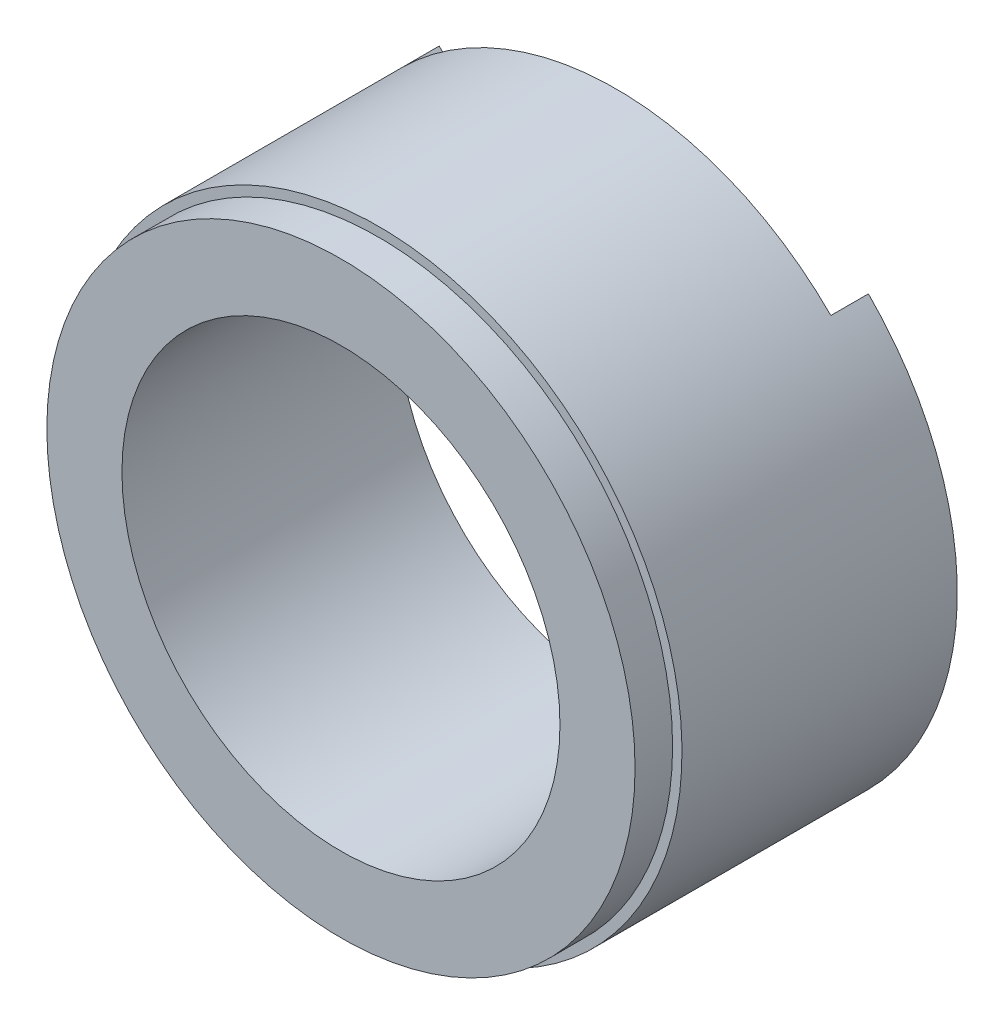
ISO-10303-21;
HEADER;
FILE_DESCRIPTION(('STEP AP214'),'2;1');
FILE_NAME('part.step','',(''),(''),'','','');
FILE_SCHEMA(('AUTOMOTIVE_DESIGN { 1 0 10303 214 1 1 1 1 }'));
ENDSEC;
DATA;
#1=APPLICATION_CONTEXT('core data for automotive mechanical design processes');
#2=APPLICATION_PROTOCOL_DEFINITION('international standard','automotive_design',2000,#1);
#3=PRODUCT_CONTEXT('',#1,'mechanical');
#4=PRODUCT('Part','Part','',(#3));
#5=PRODUCT_RELATED_PRODUCT_CATEGORY('part','',(#4));
#6=PRODUCT_DEFINITION_FORMATION('','',#4);
#7=PRODUCT_DEFINITION_CONTEXT('part definition',#1,'design');
#8=PRODUCT_DEFINITION('design','',#6,#7);
#9=PRODUCT_DEFINITION_SHAPE('','',#8);
#10=(LENGTH_UNIT() NAMED_UNIT(*) SI_UNIT(.MILLI.,.METRE.));
#11=(NAMED_UNIT(*) PLANE_ANGLE_UNIT() SI_UNIT($,.RADIAN.));
#12=(NAMED_UNIT(*) SI_UNIT($,.STERADIAN.) SOLID_ANGLE_UNIT());
#13=UNCERTAINTY_MEASURE_WITH_UNIT(LENGTH_MEASURE(1.E-05),#10,'distance_accuracy_value','');
#14=(GEOMETRIC_REPRESENTATION_CONTEXT(3) GLOBAL_UNCERTAINTY_ASSIGNED_CONTEXT((#13)) GLOBAL_UNIT_ASSIGNED_CONTEXT((#10,
#11,#12)) REPRESENTATION_CONTEXT('',''));
#15=CARTESIAN_POINT('',(0.,0.,0.));
#16=DIRECTION('',(0.,0.,1.));
#17=DIRECTION('',(1.,0.,0.));
#18=AXIS2_PLACEMENT_3D('',#15,#16,#17);
#19=CARTESIAN_POINT('',(0.,0.,0.));
#20=DIRECTION('',(0.,0.,1.));
#21=DIRECTION('',(1.,0.,0.));
#22=AXIS2_PLACEMENT_3D('',#19,#20,#21);
#23=PLANE('',#22);
#24=DIRECTION('',(-0.707106781186556,0.707106781186539,0.));
#25=VECTOR('',#24,1.);
#26=CARTESIAN_POINT('',(34.2946788875477,-34.2946788875473,0.));
#27=LINE('',#26,#25);
#28=CARTESIAN_POINT('',(34.2946788875478,-34.2946788875474,0.));
#29=VERTEX_POINT('',#28);
#30=CARTESIAN_POINT('',(32.1733585439881,-32.1733585439877,0.));
#31=VERTEX_POINT('',#30);
#32=EDGE_CURVE('E54',#29,#31,#27,.T.);
#33=ORIENTED_EDGE('',*,*,#32,.F.);
#34=CARTESIAN_POINT('',(0.,0.,0.));
#35=DIRECTION('',(0.,0.,1.));
#36=DIRECTION('',(1.,0.,0.));
#37=AXIS2_PLACEMENT_3D('',#34,#35,#36);
#38=CIRCLE('',#37,48.5);
#39=CARTESIAN_POINT('',(10.,-47.4578760586691,0.));
#40=VERTEX_POINT('',#39);
#41=EDGE_CURVE('E11',#40,#29,#38,.T.);
#42=ORIENTED_EDGE('',*,*,#41,.F.);
#43=DIRECTION('',(0.,-1.,0.));
#44=VECTOR('',#43,1.);
#45=CARTESIAN_POINT('',(10.,-48.5543279942272,0.));
#46=LINE('',#45,#44);
#47=CARTESIAN_POINT('',(10.,-44.3874982399324,0.));
#48=VERTEX_POINT('',#47);
#49=EDGE_CURVE('E224',#48,#40,#46,.T.);
#50=ORIENTED_EDGE('',*,*,#49,.F.);
#51=CARTESIAN_POINT('',(0.,0.,0.));
#52=DIRECTION('',(0.,0.,-1.));
#53=DIRECTION('',(-1.,0.,0.));
#54=AXIS2_PLACEMENT_3D('',#51,#52,#53);
#55=CIRCLE('',#54,45.5);
#56=EDGE_CURVE('E154',#31,#48,#55,.T.);
#57=ORIENTED_EDGE('',*,*,#56,.F.);
#58=EDGE_LOOP('',(#33,#42,#50,#57));
#59=FACE_BOUND('',#58,.T.);
#60=ADVANCED_FACE('F38',(#59),#23,.F.);
#61=CARTESIAN_POINT('',(34.2946788875477,34.2946788875472,0.));
#62=VERTEX_POINT('',#61);
#63=CARTESIAN_POINT('',(-34.2946788875478,34.2946788875473,0.));
#64=VERTEX_POINT('',#63);
#65=EDGE_CURVE('E46',#62,#64,#38,.T.);
#66=ORIENTED_EDGE('',*,*,#65,.F.);
#67=DIRECTION('',(-0.707106781186553,-0.707106781186542,0.));
#68=VECTOR('',#67,1.);
#69=CARTESIAN_POINT('',(34.2946788875477,34.2946788875473,0.));
#70=LINE('',#69,#68);
#71=CARTESIAN_POINT('',(32.1733585439881,32.1733585439877,0.));
#72=VERTEX_POINT('',#71);
#73=EDGE_CURVE('E155',#62,#72,#70,.T.);
#74=ORIENTED_EDGE('',*,*,#73,.T.);
#75=CARTESIAN_POINT('',(-32.1733585439881,32.1733585439877,0.));
#76=VERTEX_POINT('',#75);
#77=EDGE_CURVE('E185',#76,#72,#55,.T.);
#78=ORIENTED_EDGE('',*,*,#77,.F.);
#79=DIRECTION('',(0.707106781186552,-0.707106781186543,0.));
#80=VECTOR('',#79,1.);
#81=CARTESIAN_POINT('',(0.,0.,0.));
#82=LINE('',#81,#80);
#83=EDGE_CURVE('E211',#64,#76,#82,.T.);
#84=ORIENTED_EDGE('',*,*,#83,.F.);
#85=EDGE_LOOP('',(#66,#74,#78,#84));
#86=FACE_BOUND('',#85,.T.);
#87=ADVANCED_FACE('F212',(#86),#23,.F.);
#88=CARTESIAN_POINT('',(0.,0.,0.));
#89=DIRECTION('',(0.,0.,1.));
#90=DIRECTION('',(1.,0.,0.));
#91=AXIS2_PLACEMENT_3D('',#88,#89,#90);
#92=CIRCLE('',#91,35.);
#93=CARTESIAN_POINT('',(35.,0.,0.));
#94=VERTEX_POINT('',#93);
#95=EDGE_CURVE('E186',#94,#94,#92,.T.);
#96=ORIENTED_EDGE('',*,*,#95,.T.);
#97=EDGE_LOOP('',(#96));
#98=FACE_BOUND('',#97,.T.);
#99=CARTESIAN_POINT('',(0.,0.,0.));
#100=DIRECTION('',(0.,0.,-1.));
#101=DIRECTION('',(-1.,0.,0.));
#102=AXIS2_PLACEMENT_3D('',#99,#100,#101);
#103=CIRCLE('',#102,36.5);
#104=CARTESIAN_POINT('',(-36.5,0.,0.));
#105=VERTEX_POINT('',#104);
#106=EDGE_CURVE('E168',#105,#105,#103,.T.);
#107=ORIENTED_EDGE('',*,*,#106,.T.);
#108=EDGE_LOOP('',(#107));
#109=FACE_BOUND('',#108,.T.);
#110=ADVANCED_FACE('F276',(#98,#109),#23,.F.);
#111=CARTESIAN_POINT('',(0.,0.,44.));
#112=DIRECTION('',(0.,0.,-1.));
#113=DIRECTION('',(-1.,0.,0.));
#114=AXIS2_PLACEMENT_3D('',#111,#112,#113);
#115=CYLINDRICAL_SURFACE('',#114,48.5);
#116=CARTESIAN_POINT('',(0.,0.,38.));
#117=DIRECTION('',(0.,0.,1.));
#118=DIRECTION('',(1.,0.,0.));
#119=AXIS2_PLACEMENT_3D('',#116,#117,#118);
#120=CIRCLE('',#119,48.5);
#121=CARTESIAN_POINT('',(10.,-47.4578760586691,38.));
#122=VERTEX_POINT('',#121);
#123=CARTESIAN_POINT('',(-10.,-47.4578760586691,38.));
#124=VERTEX_POINT('',#123);
#125=EDGE_CURVE('E162',#122,#124,#120,.T.);
#126=ORIENTED_EDGE('',*,*,#125,.F.);
#127=DIRECTION('',(0.,0.,-1.));
#128=VECTOR('',#127,1.);
#129=CARTESIAN_POINT('',(10.,-47.4578760586691,44.));
#130=LINE('',#129,#128);
#131=EDGE_CURVE('E159',#122,#40,#130,.T.);
#132=ORIENTED_EDGE('',*,*,#131,.T.);
#133=ORIENTED_EDGE('',*,*,#41,.T.);
#134=DIRECTION('',(0.,0.,1.));
#135=VECTOR('',#134,1.);
#136=CARTESIAN_POINT('',(34.2946788875478,-34.2946788875474,-6.));
#137=LINE('',#136,#135);
#138=CARTESIAN_POINT('',(34.2946788875478,-34.2946788875474,-6.));
#139=VERTEX_POINT('',#138);
#140=EDGE_CURVE('E140',#139,#29,#137,.T.);
#141=ORIENTED_EDGE('',*,*,#140,.F.);
#142=CARTESIAN_POINT('',(0.,-1.69336844933892E-13,-6.));
#143=DIRECTION('',(0.,0.,1.));
#144=DIRECTION('',(1.,0.,0.));
#145=AXIS2_PLACEMENT_3D('',#142,#143,#144);
#146=CIRCLE('',#145,48.5);
#147=CARTESIAN_POINT('',(34.2946788875477,34.2946788875472,-6.));
#148=VERTEX_POINT('',#147);
#149=EDGE_CURVE('E147',#139,#148,#146,.T.);
#150=ORIENTED_EDGE('',*,*,#149,.T.);
#151=DIRECTION('',(0.,0.,1.));
#152=VECTOR('',#151,1.);
#153=CARTESIAN_POINT('',(34.2946788875477,34.2946788875472,-6.));
#154=LINE('',#153,#152);
#155=EDGE_CURVE('E148',#148,#62,#154,.T.);
#156=ORIENTED_EDGE('',*,*,#155,.T.);
#157=ORIENTED_EDGE('',*,*,#65,.T.);
#158=DIRECTION('',(0.,0.,1.));
#159=VECTOR('',#158,1.);
#160=CARTESIAN_POINT('',(-34.2946788875478,34.2946788875473,-6.));
#161=LINE('',#160,#159);
#162=CARTESIAN_POINT('',(-34.2946788875478,34.2946788875473,-6.));
#163=VERTEX_POINT('',#162);
#164=EDGE_CURVE('E205',#163,#64,#161,.T.);
#165=ORIENTED_EDGE('',*,*,#164,.F.);
#166=CARTESIAN_POINT('',(0.,0.,-6.));
#167=DIRECTION('',(0.,0.,-1.));
#168=DIRECTION('',(-1.,0.,0.));
#169=AXIS2_PLACEMENT_3D('',#166,#167,#168);
#170=CIRCLE('',#169,48.5);
#171=CARTESIAN_POINT('',(-34.2946788875477,-34.2946788875474,-6.));
#172=VERTEX_POINT('',#171);
#173=EDGE_CURVE('E485',#172,#163,#170,.T.);
#174=ORIENTED_EDGE('',*,*,#173,.F.);
#175=DIRECTION('',(0.,0.,1.));
#176=VECTOR('',#175,1.);
#177=CARTESIAN_POINT('',(-34.2946788875477,-34.2946788875474,-6.));
#178=LINE('',#177,#176);
#179=CARTESIAN_POINT('',(-34.2946788875477,-34.2946788875474,0.));
#180=VERTEX_POINT('',#179);
#181=EDGE_CURVE('E221',#172,#180,#178,.T.);
#182=ORIENTED_EDGE('',*,*,#181,.T.);
#183=CARTESIAN_POINT('',(-10.,-47.4578760586691,0.));
#184=VERTEX_POINT('',#183);
#185=EDGE_CURVE('E47',#180,#184,#38,.T.);
#186=ORIENTED_EDGE('',*,*,#185,.T.);
#187=DIRECTION('',(0.,0.,-1.));
#188=VECTOR('',#187,1.);
#189=CARTESIAN_POINT('',(-10.,-47.4578760586691,44.));
#190=LINE('',#189,#188);
#191=EDGE_CURVE('E249',#184,#124,#190,.F.);
#192=ORIENTED_EDGE('',*,*,#191,.T.);
#193=EDGE_LOOP('',(#126,#132,#133,#141,#150,#156,#157,#165,#174,#182,#186,#192));
#194=FACE_BOUND('',#193,.T.);
#195=ADVANCED_FACE('F40',(#194),#115,.T.);
#196=ORIENTED_EDGE('',*,*,#185,.F.);
#197=DIRECTION('',(0.70710678118655,0.707106781186545,0.));
#198=VECTOR('',#197,1.);
#199=CARTESIAN_POINT('',(0.,0.,0.));
#200=LINE('',#199,#198);
#201=CARTESIAN_POINT('',(-32.173358543988,-32.1733585439878,0.));
#202=VERTEX_POINT('',#201);
#203=EDGE_CURVE('E62',#180,#202,#200,.T.);
#204=ORIENTED_EDGE('',*,*,#203,.T.);
#205=CARTESIAN_POINT('',(-10.,-44.3874982399324,0.));
#206=VERTEX_POINT('',#205);
#207=EDGE_CURVE('E183',#206,#202,#55,.T.);
#208=ORIENTED_EDGE('',*,*,#207,.F.);
#209=DIRECTION('',(0.,1.,0.));
#210=VECTOR('',#209,1.);
#211=CARTESIAN_POINT('',(-10.,-48.5543279942272,0.));
#212=LINE('',#211,#210);
#213=EDGE_CURVE('E234',#184,#206,#212,.T.);
#214=ORIENTED_EDGE('',*,*,#213,.F.);
#215=EDGE_LOOP('',(#196,#204,#208,#214));
#216=FACE_BOUND('',#215,.T.);
#217=ADVANCED_FACE('F268',(#216),#23,.F.);
#218=CARTESIAN_POINT('',(0.,0.,38.));
#219=DIRECTION('',(0.,0.,1.));
#220=DIRECTION('',(1.,0.,0.));
#221=AXIS2_PLACEMENT_3D('',#218,#219,#220);
#222=PLANE('',#221);
#223=DIRECTION('',(0.,1.,0.));
#224=VECTOR('',#223,1.);
#225=CARTESIAN_POINT('',(10.,0.,38.));
#226=LINE('',#225,#224);
#227=CARTESIAN_POINT('',(10.,-45.9238500128201,38.));
#228=VERTEX_POINT('',#227);
#229=EDGE_CURVE('E166',#122,#228,#226,.T.);
#230=ORIENTED_EDGE('',*,*,#229,.F.);
#231=ORIENTED_EDGE('',*,*,#125,.T.);
#232=DIRECTION('',(0.,-1.,0.));
#233=VECTOR('',#232,1.);
#234=CARTESIAN_POINT('',(-10.,0.,38.));
#235=LINE('',#234,#233);
#236=CARTESIAN_POINT('',(-10.,-45.9238500128201,38.));
#237=VERTEX_POINT('',#236);
#238=EDGE_CURVE('E247',#237,#124,#235,.T.);
#239=ORIENTED_EDGE('',*,*,#238,.F.);
#240=CARTESIAN_POINT('',(0.,0.,38.));
#241=DIRECTION('',(0.,0.,1.));
#242=DIRECTION('',(1.,0.,0.));
#243=AXIS2_PLACEMENT_3D('',#240,#241,#242);
#244=CIRCLE('',#243,47.);
#245=EDGE_CURVE('E192',#228,#237,#244,.T.);
#246=ORIENTED_EDGE('',*,*,#245,.F.);
#247=EDGE_LOOP('',(#230,#231,#239,#246));
#248=FACE_BOUND('',#247,.T.);
#249=ADVANCED_FACE('F266',(#248),#222,.T.);
#250=CARTESIAN_POINT('',(0.,0.,38.));
#251=DIRECTION('',(0.,0.,1.));
#252=DIRECTION('',(1.,0.,0.));
#253=AXIS2_PLACEMENT_3D('',#250,#251,#252);
#254=CYLINDRICAL_SURFACE('',#253,47.);
#255=DIRECTION('',(0.,0.,1.));
#256=VECTOR('',#255,1.);
#257=CARTESIAN_POINT('',(10.,-45.9238500128201,38.));
#258=LINE('',#257,#256);
#259=CARTESIAN_POINT('',(10.,-45.9238500128201,42.));
#260=VERTEX_POINT('',#259);
#261=EDGE_CURVE('E170',#228,#260,#258,.T.);
#262=ORIENTED_EDGE('',*,*,#261,.F.);
#263=ORIENTED_EDGE('',*,*,#245,.T.);
#264=DIRECTION('',(0.,0.,1.));
#265=VECTOR('',#264,1.);
#266=CARTESIAN_POINT('',(-10.,-45.9238500128201,38.));
#267=LINE('',#266,#265);
#268=CARTESIAN_POINT('',(-10.,-45.9238500128201,42.));
#269=VERTEX_POINT('',#268);
#270=EDGE_CURVE('E243',#269,#237,#267,.F.);
#271=ORIENTED_EDGE('',*,*,#270,.F.);
#272=CARTESIAN_POINT('',(0.,0.,42.));
#273=DIRECTION('',(0.,0.,1.));
#274=DIRECTION('',(1.,0.,0.));
#275=AXIS2_PLACEMENT_3D('',#272,#273,#274);
#276=CIRCLE('',#275,47.);
#277=EDGE_CURVE('E165',#260,#269,#276,.F.);
#278=ORIENTED_EDGE('',*,*,#277,.F.);
#279=EDGE_LOOP('',(#262,#263,#271,#278));
#280=FACE_BOUND('',#279,.T.);
#281=CARTESIAN_POINT('',(0.,0.,44.));
#282=DIRECTION('',(0.,0.,1.));
#283=DIRECTION('',(1.,0.,0.));
#284=AXIS2_PLACEMENT_3D('',#281,#282,#283);
#285=CIRCLE('',#284,47.);
#286=CARTESIAN_POINT('',(47.,0.,44.));
#287=VERTEX_POINT('',#286);
#288=EDGE_CURVE('E189',#287,#287,#285,.T.);
#289=ORIENTED_EDGE('',*,*,#288,.F.);
#290=EDGE_LOOP('',(#289));
#291=FACE_BOUND('',#290,.T.);
#292=ADVANCED_FACE('F262',(#280,#291),#254,.T.);
#293=CARTESIAN_POINT('',(0.,0.,44.));
#294=DIRECTION('',(0.,0.,1.));
#295=DIRECTION('',(1.,0.,0.));
#296=AXIS2_PLACEMENT_3D('',#293,#294,#295);
#297=PLANE('',#296);
#298=CARTESIAN_POINT('',(0.,0.,44.));
#299=DIRECTION('',(0.,0.,1.));
#300=DIRECTION('',(1.,0.,0.));
#301=AXIS2_PLACEMENT_3D('',#298,#299,#300);
#302=CIRCLE('',#301,35.);
#303=CARTESIAN_POINT('',(35.,0.,44.));
#304=VERTEX_POINT('',#303);
#305=EDGE_CURVE('E182',#304,#304,#302,.T.);
#306=ORIENTED_EDGE('',*,*,#305,.F.);
#307=EDGE_LOOP('',(#306));
#308=FACE_BOUND('',#307,.T.);
#309=ORIENTED_EDGE('',*,*,#288,.T.);
#310=EDGE_LOOP('',(#309));
#311=FACE_BOUND('',#310,.T.);
#312=ADVANCED_FACE('F274',(#308,#311),#297,.T.);
#313=CARTESIAN_POINT('',(0.,0.,0.));
#314=DIRECTION('',(0.,0.,1.));
#315=DIRECTION('',(1.,0.,0.));
#316=AXIS2_PLACEMENT_3D('',#313,#314,#315);
#317=CYLINDRICAL_SURFACE('',#316,35.);
#318=ORIENTED_EDGE('',*,*,#95,.F.);
#319=EDGE_LOOP('',(#318));
#320=FACE_BOUND('',#319,.T.);
#321=ORIENTED_EDGE('',*,*,#305,.T.);
#322=EDGE_LOOP('',(#321));
#323=FACE_BOUND('',#322,.T.);
#324=ADVANCED_FACE('F283',(#320,#323),#317,.F.);
#325=CARTESIAN_POINT('',(0.,0.,42.));
#326=DIRECTION('',(0.,0.,-1.));
#327=DIRECTION('',(-1.,0.,0.));
#328=AXIS2_PLACEMENT_3D('',#325,#326,#327);
#329=CYLINDRICAL_SURFACE('',#328,45.5);
#330=ORIENTED_EDGE('',*,*,#207,.T.);
#331=DIRECTION('',(0.,0.,1.));
#332=VECTOR('',#331,1.);
#333=CARTESIAN_POINT('',(-32.173358543988,-32.1733585439878,-6.));
#334=LINE('',#333,#332);
#335=CARTESIAN_POINT('',(-32.173358543988,-32.1733585439878,-6.));
#336=VERTEX_POINT('',#335);
#337=EDGE_CURVE('E226',#336,#202,#334,.T.);
#338=ORIENTED_EDGE('',*,*,#337,.F.);
#339=CARTESIAN_POINT('',(0.,0.,-6.));
#340=DIRECTION('',(0.,0.,-1.));
#341=DIRECTION('',(-1.,0.,0.));
#342=AXIS2_PLACEMENT_3D('',#339,#340,#341);
#343=CIRCLE('',#342,45.5);
#344=CARTESIAN_POINT('',(-32.1733585439881,32.1733585439877,-6.));
#345=VERTEX_POINT('',#344);
#346=EDGE_CURVE('E488',#345,#336,#343,.F.);
#347=ORIENTED_EDGE('',*,*,#346,.F.);
#348=DIRECTION('',(0.,0.,1.));
#349=VECTOR('',#348,1.);
#350=CARTESIAN_POINT('',(-32.1733585439881,32.1733585439877,-6.));
#351=LINE('',#350,#349);
#352=EDGE_CURVE('E222',#345,#76,#351,.T.);
#353=ORIENTED_EDGE('',*,*,#352,.T.);
#354=ORIENTED_EDGE('',*,*,#77,.T.);
#355=DIRECTION('',(0.,0.,1.));
#356=VECTOR('',#355,1.);
#357=CARTESIAN_POINT('',(32.1733585439881,32.1733585439877,-6.));
#358=LINE('',#357,#356);
#359=CARTESIAN_POINT('',(32.1733585439881,32.1733585439877,-6.));
#360=VERTEX_POINT('',#359);
#361=EDGE_CURVE('E473',#360,#72,#358,.T.);
#362=ORIENTED_EDGE('',*,*,#361,.F.);
#363=CARTESIAN_POINT('',(0.,-1.69336844933892E-13,-6.));
#364=DIRECTION('',(0.,0.,1.));
#365=DIRECTION('',(1.,0.,0.));
#366=AXIS2_PLACEMENT_3D('',#363,#364,#365);
#367=CIRCLE('',#366,45.5);
#368=CARTESIAN_POINT('',(32.1733585439882,-32.1733585439878,-6.));
#369=VERTEX_POINT('',#368);
#370=EDGE_CURVE('E475',#369,#360,#367,.T.);
#371=ORIENTED_EDGE('',*,*,#370,.F.);
#372=DIRECTION('',(0.,0.,1.));
#373=VECTOR('',#372,1.);
#374=CARTESIAN_POINT('',(32.1733585439882,-32.1733585439878,-6.));
#375=LINE('',#374,#373);
#376=EDGE_CURVE('E495',#369,#31,#375,.T.);
#377=ORIENTED_EDGE('',*,*,#376,.T.);
#378=ORIENTED_EDGE('',*,*,#56,.T.);
#379=DIRECTION('',(0.,0.,-1.));
#380=VECTOR('',#379,1.);
#381=CARTESIAN_POINT('',(10.,-44.3874982399324,42.));
#382=LINE('',#381,#380);
#383=CARTESIAN_POINT('',(10.,-44.3874982399324,42.));
#384=VERTEX_POINT('',#383);
#385=EDGE_CURVE('E240',#384,#48,#382,.T.);
#386=ORIENTED_EDGE('',*,*,#385,.F.);
#387=CARTESIAN_POINT('',(0.,0.,42.));
#388=DIRECTION('',(0.,0.,-1.));
#389=DIRECTION('',(-1.,0.,0.));
#390=AXIS2_PLACEMENT_3D('',#387,#388,#389);
#391=CIRCLE('',#390,45.5);
#392=CARTESIAN_POINT('',(-10.,-44.3874982399324,42.));
#393=VERTEX_POINT('',#392);
#394=EDGE_CURVE('E179',#393,#384,#391,.T.);
#395=ORIENTED_EDGE('',*,*,#394,.F.);
#396=DIRECTION('',(0.,0.,-1.));
#397=VECTOR('',#396,1.);
#398=CARTESIAN_POINT('',(-10.,-44.3874982399324,42.));
#399=LINE('',#398,#397);
#400=EDGE_CURVE('E237',#393,#206,#399,.T.);
#401=ORIENTED_EDGE('',*,*,#400,.T.);
#402=EDGE_LOOP('',(#330,#338,#347,#353,#354,#362,#371,#377,#378,#386,#395,#401));
#403=FACE_BOUND('',#402,.T.);
#404=ADVANCED_FACE('F288',(#403),#329,.F.);
#405=CARTESIAN_POINT('',(0.,0.,42.));
#406=DIRECTION('',(0.,0.,-1.));
#407=DIRECTION('',(-1.,0.,0.));
#408=AXIS2_PLACEMENT_3D('',#405,#406,#407);
#409=PLANE('',#408);
#410=ORIENTED_EDGE('',*,*,#394,.T.);
#411=DIRECTION('',(0.,-1.,0.));
#412=VECTOR('',#411,1.);
#413=CARTESIAN_POINT('',(10.,-48.5543279942272,42.));
#414=LINE('',#413,#412);
#415=EDGE_CURVE('E230',#384,#260,#414,.T.);
#416=ORIENTED_EDGE('',*,*,#415,.T.);
#417=ORIENTED_EDGE('',*,*,#277,.T.);
#418=DIRECTION('',(0.,1.,0.));
#419=VECTOR('',#418,1.);
#420=CARTESIAN_POINT('',(-10.,-48.5543279942272,42.));
#421=LINE('',#420,#419);
#422=EDGE_CURVE('E233',#269,#393,#421,.T.);
#423=ORIENTED_EDGE('',*,*,#422,.T.);
#424=EDGE_LOOP('',(#410,#416,#417,#423));
#425=FACE_BOUND('',#424,.T.);
#426=CARTESIAN_POINT('',(0.,0.,42.));
#427=DIRECTION('',(0.,0.,-1.));
#428=DIRECTION('',(-1.,0.,0.));
#429=AXIS2_PLACEMENT_3D('',#426,#427,#428);
#430=CIRCLE('',#429,36.5);
#431=CARTESIAN_POINT('',(-36.5,0.,42.));
#432=VERTEX_POINT('',#431);
#433=EDGE_CURVE('E174',#432,#432,#430,.T.);
#434=ORIENTED_EDGE('',*,*,#433,.F.);
#435=EDGE_LOOP('',(#434));
#436=FACE_BOUND('',#435,.T.);
#437=ADVANCED_FACE('F257',(#425,#436),#409,.T.);
#438=CARTESIAN_POINT('',(0.,0.,42.));
#439=DIRECTION('',(0.,0.,-1.));
#440=DIRECTION('',(-1.,0.,0.));
#441=AXIS2_PLACEMENT_3D('',#438,#439,#440);
#442=CYLINDRICAL_SURFACE('',#441,36.5);
#443=ORIENTED_EDGE('',*,*,#433,.T.);
#444=EDGE_LOOP('',(#443));
#445=FACE_BOUND('',#444,.T.);
#446=ORIENTED_EDGE('',*,*,#106,.F.);
#447=EDGE_LOOP('',(#446));
#448=FACE_BOUND('',#447,.T.);
#449=ADVANCED_FACE('F304',(#445,#448),#442,.T.);
#450=CARTESIAN_POINT('',(10.,-48.5543279942272,42.));
#451=DIRECTION('',(1.,0.,0.));
#452=DIRECTION('',(0.,0.,-1.));
#453=AXIS2_PLACEMENT_3D('',#450,#451,#452);
#454=PLANE('',#453);
#455=ORIENTED_EDGE('',*,*,#229,.T.);
#456=ORIENTED_EDGE('',*,*,#261,.T.);
#457=ORIENTED_EDGE('',*,*,#415,.F.);
#458=ORIENTED_EDGE('',*,*,#385,.T.);
#459=ORIENTED_EDGE('',*,*,#49,.T.);
#460=ORIENTED_EDGE('',*,*,#131,.F.);
#461=EDGE_LOOP('',(#455,#456,#457,#458,#459,#460));
#462=FACE_BOUND('',#461,.T.);
#463=ADVANCED_FACE('F251',(#462),#454,.F.);
#464=CARTESIAN_POINT('',(-10.,-48.5543279942272,42.));
#465=DIRECTION('',(-1.,0.,0.));
#466=DIRECTION('',(0.,0.,1.));
#467=AXIS2_PLACEMENT_3D('',#464,#465,#466);
#468=PLANE('',#467);
#469=ORIENTED_EDGE('',*,*,#213,.T.);
#470=ORIENTED_EDGE('',*,*,#400,.F.);
#471=ORIENTED_EDGE('',*,*,#422,.F.);
#472=ORIENTED_EDGE('',*,*,#270,.T.);
#473=ORIENTED_EDGE('',*,*,#238,.T.);
#474=ORIENTED_EDGE('',*,*,#191,.F.);
#475=EDGE_LOOP('',(#469,#470,#471,#472,#473,#474));
#476=FACE_BOUND('',#475,.T.);
#477=ADVANCED_FACE('F265',(#476),#468,.F.);
#478=CARTESIAN_POINT('',(0.,0.,-6.));
#479=DIRECTION('',(0.707106781186545,-0.70710678118655,0.));
#480=DIRECTION('',(0.70710678118655,0.707106781186545,0.));
#481=AXIS2_PLACEMENT_3D('',#478,#479,#480);
#482=PLANE('',#481);
#483=ORIENTED_EDGE('',*,*,#203,.F.);
#484=ORIENTED_EDGE('',*,*,#181,.F.);
#485=DIRECTION('',(0.70710678118655,0.707106781186545,0.));
#486=VECTOR('',#485,1.);
#487=CARTESIAN_POINT('',(0.,0.,-6.));
#488=LINE('',#487,#486);
#489=EDGE_CURVE('E217',#172,#336,#488,.T.);
#490=ORIENTED_EDGE('',*,*,#489,.T.);
#491=ORIENTED_EDGE('',*,*,#337,.T.);
#492=EDGE_LOOP('',(#483,#484,#490,#491));
#493=FACE_BOUND('',#492,.T.);
#494=ADVANCED_FACE('F312',(#493),#482,.T.);
#495=CARTESIAN_POINT('',(0.,0.,-6.));
#496=DIRECTION('',(-0.707106781186543,-0.707106781186552,0.));
#497=DIRECTION('',(0.707106781186552,-0.707106781186543,0.));
#498=AXIS2_PLACEMENT_3D('',#495,#496,#497);
#499=PLANE('',#498);
#500=ORIENTED_EDGE('',*,*,#83,.T.);
#501=ORIENTED_EDGE('',*,*,#352,.F.);
#502=DIRECTION('',(0.707106781186552,-0.707106781186543,0.));
#503=VECTOR('',#502,1.);
#504=CARTESIAN_POINT('',(0.,0.,-6.));
#505=LINE('',#504,#503);
#506=EDGE_CURVE('E220',#163,#345,#505,.T.);
#507=ORIENTED_EDGE('',*,*,#506,.F.);
#508=ORIENTED_EDGE('',*,*,#164,.T.);
#509=EDGE_LOOP('',(#500,#501,#507,#508));
#510=FACE_BOUND('',#509,.T.);
#511=ADVANCED_FACE('F219',(#510),#499,.F.);
#512=CARTESIAN_POINT('',(0.,0.,-6.));
#513=DIRECTION('',(0.,0.,-1.));
#514=DIRECTION('',(-1.,0.,0.));
#515=AXIS2_PLACEMENT_3D('',#512,#513,#514);
#516=PLANE('',#515);
#517=ORIENTED_EDGE('',*,*,#489,.F.);
#518=ORIENTED_EDGE('',*,*,#173,.T.);
#519=ORIENTED_EDGE('',*,*,#506,.T.);
#520=ORIENTED_EDGE('',*,*,#346,.T.);
#521=EDGE_LOOP('',(#517,#518,#519,#520));
#522=FACE_BOUND('',#521,.T.);
#523=ADVANCED_FACE('F318',(#522),#516,.T.);
#524=CARTESIAN_POINT('',(34.2946788875477,-34.2946788875473,-6.));
#525=DIRECTION('',(0.707106781186539,0.707106781186556,0.));
#526=DIRECTION('',(-0.707106781186556,0.707106781186539,0.));
#527=AXIS2_PLACEMENT_3D('',#524,#525,#526);
#528=PLANE('',#527);
#529=ORIENTED_EDGE('',*,*,#32,.T.);
#530=ORIENTED_EDGE('',*,*,#376,.F.);
#531=DIRECTION('',(-0.707106781186556,0.707106781186539,0.));
#532=VECTOR('',#531,1.);
#533=CARTESIAN_POINT('',(34.2946788875477,-34.2946788875473,-6.));
#534=LINE('',#533,#532);
#535=EDGE_CURVE('E143',#139,#369,#534,.T.);
#536=ORIENTED_EDGE('',*,*,#535,.F.);
#537=ORIENTED_EDGE('',*,*,#140,.T.);
#538=EDGE_LOOP('',(#529,#530,#536,#537));
#539=FACE_BOUND('',#538,.T.);
#540=ADVANCED_FACE('F141',(#539),#528,.F.);
#541=CARTESIAN_POINT('',(34.2946788875477,34.2946788875473,-6.));
#542=DIRECTION('',(-0.707106781186542,0.707106781186553,0.));
#543=DIRECTION('',(-0.707106781186553,-0.707106781186542,0.));
#544=AXIS2_PLACEMENT_3D('',#541,#542,#543);
#545=PLANE('',#544);
#546=ORIENTED_EDGE('',*,*,#73,.F.);
#547=ORIENTED_EDGE('',*,*,#155,.F.);
#548=DIRECTION('',(-0.707106781186553,-0.707106781186542,0.));
#549=VECTOR('',#548,1.);
#550=CARTESIAN_POINT('',(34.2946788875477,34.2946788875473,-6.));
#551=LINE('',#550,#549);
#552=EDGE_CURVE('E480',#148,#360,#551,.T.);
#553=ORIENTED_EDGE('',*,*,#552,.T.);
#554=ORIENTED_EDGE('',*,*,#361,.T.);
#555=EDGE_LOOP('',(#546,#547,#553,#554));
#556=FACE_BOUND('',#555,.T.);
#557=ADVANCED_FACE('F325',(#556),#545,.T.);
#558=CARTESIAN_POINT('',(0.,-1.69336844933892E-13,-6.));
#559=DIRECTION('',(0.,0.,1.));
#560=DIRECTION('',(1.,0.,0.));
#561=AXIS2_PLACEMENT_3D('',#558,#559,#560);
#562=PLANE('',#561);
#563=ORIENTED_EDGE('',*,*,#535,.T.);
#564=ORIENTED_EDGE('',*,*,#370,.T.);
#565=ORIENTED_EDGE('',*,*,#552,.F.);
#566=ORIENTED_EDGE('',*,*,#149,.F.);
#567=EDGE_LOOP('',(#563,#564,#565,#566));
#568=FACE_BOUND('',#567,.T.);
#569=ADVANCED_FACE('F322',(#568),#562,.F.);
#570=CLOSED_SHELL('',(#60,#87,#110,#195,#217,#249,#292,#312,#324,#404,#437,#449,#463,#477,#494,
#511,#523,#540,#557,#569));
#571=MANIFOLD_SOLID_BREP('B2',#570);
#572=ADVANCED_BREP_SHAPE_REPRESENTATION('',(#18,#571),#14);
#573=SHAPE_DEFINITION_REPRESENTATION(#9,#572);
ENDSEC;
END-ISO-10303-21;
